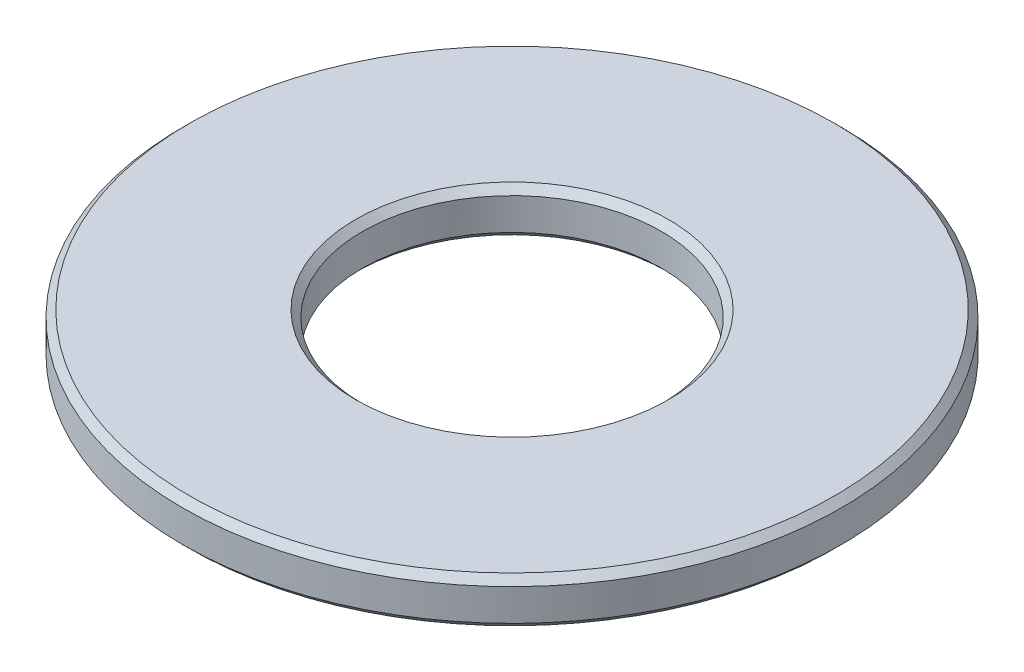
ISO-10303-21;
HEADER;
FILE_DESCRIPTION(('STEP AP214'),'2;1');
FILE_NAME('part.step','',(''),(''),'','','');
FILE_SCHEMA(('AUTOMOTIVE_DESIGN { 1 0 10303 214 1 1 1 1 }'));
ENDSEC;
DATA;
#1=APPLICATION_CONTEXT('core data for automotive mechanical design processes');
#2=APPLICATION_PROTOCOL_DEFINITION('international standard','automotive_design',2000,#1);
#3=PRODUCT_CONTEXT('',#1,'mechanical');
#4=PRODUCT('Part','Part','',(#3));
#5=PRODUCT_RELATED_PRODUCT_CATEGORY('part','',(#4));
#6=PRODUCT_DEFINITION_FORMATION('','',#4);
#7=PRODUCT_DEFINITION_CONTEXT('part definition',#1,'design');
#8=PRODUCT_DEFINITION('design','',#6,#7);
#9=PRODUCT_DEFINITION_SHAPE('','',#8);
#10=(LENGTH_UNIT() NAMED_UNIT(*) SI_UNIT(.MILLI.,.METRE.));
#11=(NAMED_UNIT(*) PLANE_ANGLE_UNIT() SI_UNIT($,.RADIAN.));
#12=(NAMED_UNIT(*) SI_UNIT($,.STERADIAN.) SOLID_ANGLE_UNIT());
#13=UNCERTAINTY_MEASURE_WITH_UNIT(LENGTH_MEASURE(1.E-05),#10,'distance_accuracy_value','');
#14=(GEOMETRIC_REPRESENTATION_CONTEXT(3) GLOBAL_UNCERTAINTY_ASSIGNED_CONTEXT((#13)) GLOBAL_UNIT_ASSIGNED_CONTEXT((#10,
#11,#12)) REPRESENTATION_CONTEXT('',''));
#15=CARTESIAN_POINT('',(0.,0.,0.));
#16=DIRECTION('',(0.,0.,1.));
#17=DIRECTION('',(1.,0.,0.));
#18=AXIS2_PLACEMENT_3D('',#15,#16,#17);
#19=CARTESIAN_POINT('',(0.,0.,0.));
#20=DIRECTION('',(0.,1.,0.));
#21=DIRECTION('',(0.,0.,1.));
#22=AXIS2_PLACEMENT_3D('',#19,#20,#21);
#23=PLANE('',#22);
#24=CARTESIAN_POINT('',(0.,0.,0.));
#25=DIRECTION('',(0.,-1.,0.));
#26=DIRECTION('',(0.,0.,-1.));
#27=AXIS2_PLACEMENT_3D('',#24,#25,#26);
#28=CIRCLE('',#27,4.51800000007552);
#29=CARTESIAN_POINT('',(0.,0.,-4.51800000007552));
#30=VERTEX_POINT('',#29);
#31=EDGE_CURVE('E32',#30,#30,#28,.F.);
#32=ORIENTED_EDGE('',*,*,#31,.T.);
#33=EDGE_LOOP('',(#32));
#34=FACE_BOUND('',#33,.T.);
#35=CARTESIAN_POINT('',(0.,0.,0.));
#36=DIRECTION('',(0.,1.,0.));
#37=DIRECTION('',(-1.,0.,0.));
#38=AXIS2_PLACEMENT_3D('',#35,#36,#37);
#39=CIRCLE('',#38,9.325);
#40=CARTESIAN_POINT('',(-9.325,0.,0.));
#41=VERTEX_POINT('',#40);
#42=EDGE_CURVE('E18',#41,#41,#39,.T.);
#43=ORIENTED_EDGE('',*,*,#42,.F.);
#44=EDGE_LOOP('',(#43));
#45=FACE_BOUND('',#44,.T.);
#46=ADVANCED_FACE('F15',(#34,#45),#23,.F.);
#47=CARTESIAN_POINT('',(0.,0.200000000000001,0.));
#48=DIRECTION('',(0.,1.,0.));
#49=DIRECTION('',(-1.,0.,0.));
#50=AXIS2_PLACEMENT_3D('',#47,#48,#49);
#51=CONICAL_SURFACE('',#50,9.525,0.785398163397449);
#52=CARTESIAN_POINT('',(0.,0.2,0.));
#53=DIRECTION('',(0.,1.,0.));
#54=DIRECTION('',(0.,0.,1.));
#55=AXIS2_PLACEMENT_3D('',#52,#53,#54);
#56=CIRCLE('',#55,9.525);
#57=CARTESIAN_POINT('',(0.,0.2,9.525));
#58=VERTEX_POINT('',#57);
#59=EDGE_CURVE('E34',#58,#58,#56,.T.);
#60=ORIENTED_EDGE('',*,*,#59,.F.);
#61=EDGE_LOOP('',(#60));
#62=FACE_BOUND('',#61,.T.);
#63=ORIENTED_EDGE('',*,*,#42,.T.);
#64=EDGE_LOOP('',(#63));
#65=FACE_BOUND('',#64,.T.);
#66=ADVANCED_FACE('F42',(#62,#65),#51,.T.);
#67=CARTESIAN_POINT('',(0.,0.,0.));
#68=DIRECTION('',(0.,-1.,0.));
#69=DIRECTION('',(0.,0.,-1.));
#70=AXIS2_PLACEMENT_3D('',#67,#68,#69);
#71=CONICAL_SURFACE('',#70,4.51800000007552,0.785398163539557);
#72=CARTESIAN_POINT('',(0.,0.2,0.));
#73=DIRECTION('',(0.,1.,0.));
#74=DIRECTION('',(0.,0.,1.));
#75=AXIS2_PLACEMENT_3D('',#72,#73,#74);
#76=CIRCLE('',#75,4.318);
#77=CARTESIAN_POINT('',(0.,0.2,4.318));
#78=VERTEX_POINT('',#77);
#79=EDGE_CURVE('E38',#78,#78,#76,.T.);
#80=ORIENTED_EDGE('',*,*,#79,.T.);
#81=EDGE_LOOP('',(#80));
#82=FACE_BOUND('',#81,.T.);
#83=ORIENTED_EDGE('',*,*,#31,.F.);
#84=EDGE_LOOP('',(#83));
#85=FACE_BOUND('',#84,.T.);
#86=ADVANCED_FACE('F49',(#82,#85),#71,.F.);
#87=CARTESIAN_POINT('',(0.,1.3208,0.));
#88=DIRECTION('',(0.,1.,0.));
#89=DIRECTION('',(0.,0.,1.));
#90=AXIS2_PLACEMENT_3D('',#87,#88,#89);
#91=CYLINDRICAL_SURFACE('',#90,9.525);
#92=ORIENTED_EDGE('',*,*,#59,.T.);
#93=EDGE_LOOP('',(#92));
#94=FACE_BOUND('',#93,.T.);
#95=CARTESIAN_POINT('',(0.,1.1208,0.));
#96=DIRECTION('',(0.,-1.,0.));
#97=DIRECTION('',(0.,0.,-1.));
#98=AXIS2_PLACEMENT_3D('',#95,#96,#97);
#99=CIRCLE('',#98,9.525);
#100=CARTESIAN_POINT('',(0.,1.1208,-9.525));
#101=VERTEX_POINT('',#100);
#102=EDGE_CURVE('E81',#101,#101,#99,.F.);
#103=ORIENTED_EDGE('',*,*,#102,.F.);
#104=EDGE_LOOP('',(#103));
#105=FACE_BOUND('',#104,.T.);
#106=ADVANCED_FACE('F69',(#94,#105),#91,.T.);
#107=CARTESIAN_POINT('',(0.,1.3208,0.));
#108=DIRECTION('',(0.,1.,0.));
#109=DIRECTION('',(0.,0.,1.));
#110=AXIS2_PLACEMENT_3D('',#107,#108,#109);
#111=CYLINDRICAL_SURFACE('',#110,4.318);
#112=ORIENTED_EDGE('',*,*,#79,.F.);
#113=EDGE_LOOP('',(#112));
#114=FACE_BOUND('',#113,.T.);
#115=CARTESIAN_POINT('',(0.,1.12080000002379,0.));
#116=DIRECTION('',(0.,1.,0.));
#117=DIRECTION('',(0.,0.,1.));
#118=AXIS2_PLACEMENT_3D('',#115,#116,#117);
#119=CIRCLE('',#118,4.31800000001203);
#120=CARTESIAN_POINT('',(0.,1.12080000002379,4.31800000001203));
#121=VERTEX_POINT('',#120);
#122=EDGE_CURVE('E27',#121,#121,#119,.T.);
#123=ORIENTED_EDGE('',*,*,#122,.T.);
#124=EDGE_LOOP('',(#123));
#125=FACE_BOUND('',#124,.T.);
#126=ADVANCED_FACE('F65',(#114,#125),#111,.F.);
#127=CARTESIAN_POINT('',(0.,1.1208,0.));
#128=DIRECTION('',(0.,-1.,0.));
#129=DIRECTION('',(0.,0.,-1.));
#130=AXIS2_PLACEMENT_3D('',#127,#128,#129);
#131=CONICAL_SURFACE('',#130,9.525,0.785398163397448);
#132=CARTESIAN_POINT('',(0.,1.3208,0.));
#133=DIRECTION('',(0.,-1.,0.));
#134=DIRECTION('',(0.,0.,-1.));
#135=AXIS2_PLACEMENT_3D('',#132,#133,#134);
#136=CIRCLE('',#135,9.325);
#137=CARTESIAN_POINT('',(0.,1.3208,-9.325));
#138=VERTEX_POINT('',#137);
#139=EDGE_CURVE('E22',#138,#138,#136,.F.);
#140=ORIENTED_EDGE('',*,*,#139,.F.);
#141=EDGE_LOOP('',(#140));
#142=FACE_BOUND('',#141,.T.);
#143=ORIENTED_EDGE('',*,*,#102,.T.);
#144=EDGE_LOOP('',(#143));
#145=FACE_BOUND('',#144,.T.);
#146=ADVANCED_FACE('F58',(#142,#145),#131,.T.);
#147=CARTESIAN_POINT('',(0.,1.32079999997359,0.));
#148=DIRECTION('',(0.,1.,0.));
#149=DIRECTION('',(0.,0.,1.));
#150=AXIS2_PLACEMENT_3D('',#147,#148,#149);
#151=CONICAL_SURFACE('',#150,4.51799999996183,0.785398163397448);
#152=CARTESIAN_POINT('',(0.,1.32079999997359,0.));
#153=DIRECTION('',(0.,1.,0.));
#154=DIRECTION('',(0.,0.,1.));
#155=AXIS2_PLACEMENT_3D('',#152,#153,#154);
#156=CIRCLE('',#155,4.51799999996183);
#157=CARTESIAN_POINT('',(0.,1.32079999997359,4.51799999996183));
#158=VERTEX_POINT('',#157);
#159=EDGE_CURVE('E10',#158,#158,#156,.F.);
#160=ORIENTED_EDGE('',*,*,#159,.F.);
#161=EDGE_LOOP('',(#160));
#162=FACE_BOUND('',#161,.T.);
#163=ORIENTED_EDGE('',*,*,#122,.F.);
#164=EDGE_LOOP('',(#163));
#165=FACE_BOUND('',#164,.T.);
#166=ADVANCED_FACE('F53',(#162,#165),#151,.F.);
#167=CARTESIAN_POINT('',(0.,1.3208,0.));
#168=DIRECTION('',(0.,1.,0.));
#169=DIRECTION('',(0.,0.,1.));
#170=AXIS2_PLACEMENT_3D('',#167,#168,#169);
#171=PLANE('',#170);
#172=ORIENTED_EDGE('',*,*,#159,.T.);
#173=EDGE_LOOP('',(#172));
#174=FACE_BOUND('',#173,.T.);
#175=ORIENTED_EDGE('',*,*,#139,.T.);
#176=EDGE_LOOP('',(#175));
#177=FACE_BOUND('',#176,.T.);
#178=ADVANCED_FACE('F51',(#174,#177),#171,.T.);
#179=CLOSED_SHELL('',(#46,#66,#86,#106,#126,#146,#166,#178));
#180=MANIFOLD_SOLID_BREP('B1',#179);
#181=ADVANCED_BREP_SHAPE_REPRESENTATION('',(#18,#180),#14);
#182=SHAPE_DEFINITION_REPRESENTATION(#9,#181);
ENDSEC;
END-ISO-10303-21;
